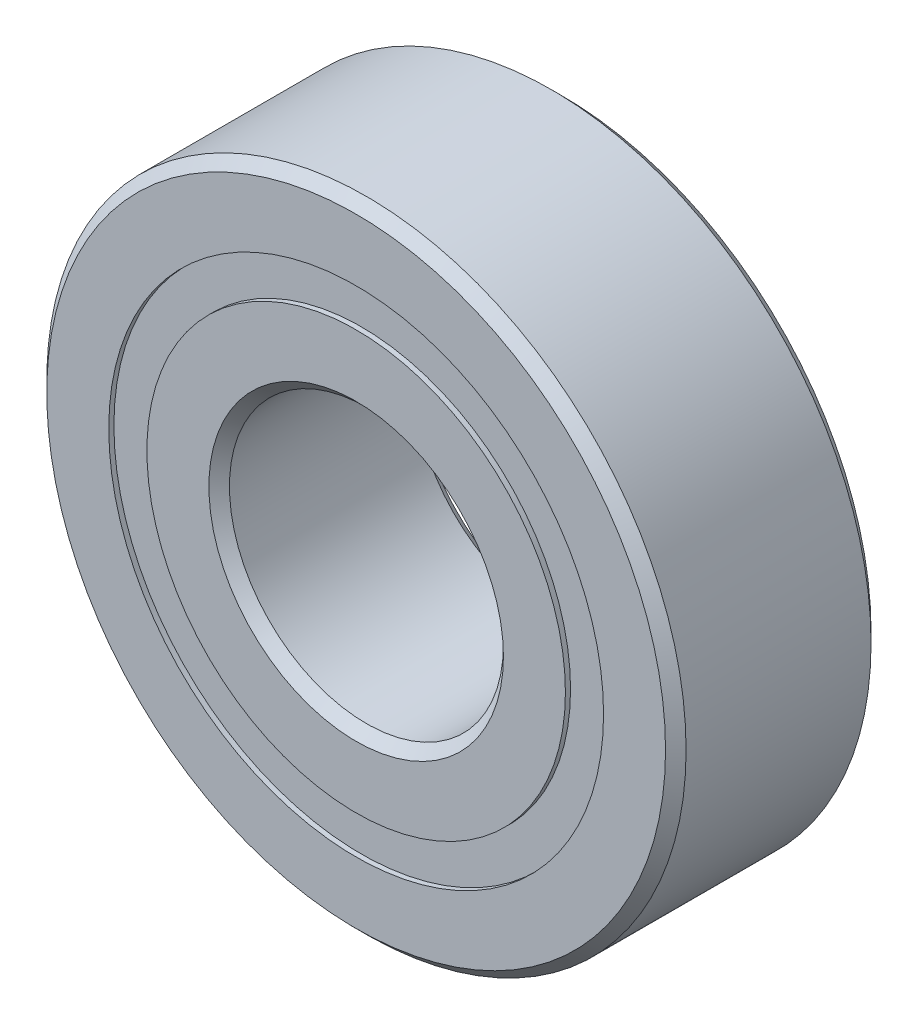
ISO-10303-21;
HEADER;
FILE_DESCRIPTION(('STEP AP214'),'2;1');
FILE_NAME('part.step','',(''),(''),'','','');
FILE_SCHEMA(('AUTOMOTIVE_DESIGN { 1 0 10303 214 1 1 1 1 }'));
ENDSEC;
DATA;
#1=APPLICATION_CONTEXT('core data for automotive mechanical design processes');
#2=APPLICATION_PROTOCOL_DEFINITION('international standard','automotive_design',2000,#1);
#3=PRODUCT_CONTEXT('',#1,'mechanical');
#4=PRODUCT('Part','Part','',(#3));
#5=PRODUCT_RELATED_PRODUCT_CATEGORY('part','',(#4));
#6=PRODUCT_DEFINITION_FORMATION('','',#4);
#7=PRODUCT_DEFINITION_CONTEXT('part definition',#1,'design');
#8=PRODUCT_DEFINITION('design','',#6,#7);
#9=PRODUCT_DEFINITION_SHAPE('','',#8);
#10=(LENGTH_UNIT() NAMED_UNIT(*) SI_UNIT(.MILLI.,.METRE.));
#11=(NAMED_UNIT(*) PLANE_ANGLE_UNIT() SI_UNIT($,.RADIAN.));
#12=(NAMED_UNIT(*) SI_UNIT($,.STERADIAN.) SOLID_ANGLE_UNIT());
#13=UNCERTAINTY_MEASURE_WITH_UNIT(LENGTH_MEASURE(1.E-05),#10,'distance_accuracy_value','');
#14=(GEOMETRIC_REPRESENTATION_CONTEXT(3) GLOBAL_UNCERTAINTY_ASSIGNED_CONTEXT((#13)) GLOBAL_UNIT_ASSIGNED_CONTEXT((#10,
#11,#12)) REPRESENTATION_CONTEXT('',''));
#15=CARTESIAN_POINT('',(0.,0.,0.));
#16=DIRECTION('',(0.,0.,1.));
#17=DIRECTION('',(1.,0.,0.));
#18=AXIS2_PLACEMENT_3D('',#15,#16,#17);
#19=CARTESIAN_POINT('',(0.,8.60041208791209,-3.39328125));
#20=DIRECTION('',(0.,0.,1.));
#21=DIRECTION('',(1.,0.,0.));
#22=AXIS2_PLACEMENT_3D('',#19,#20,#21);
#23=PLANE('',#22);
#24=CARTESIAN_POINT('',(0.,0.,-3.39328125));
#25=DIRECTION('',(0.,0.,1.));
#26=DIRECTION('',(1.,0.,0.));
#27=AXIS2_PLACEMENT_3D('',#24,#25,#26);
#28=CIRCLE('',#27,8.60041208791209);
#29=CARTESIAN_POINT('',(8.60041208791209,0.,-3.39328125));
#30=VERTEX_POINT('',#29);
#31=EDGE_CURVE('E59',#30,#30,#28,.T.);
#32=ORIENTED_EDGE('',*,*,#31,.F.);
#33=EDGE_LOOP('',(#32));
#34=FACE_BOUND('',#33,.T.);
#35=CARTESIAN_POINT('',(0.,0.,-3.39328125));
#36=DIRECTION('',(0.,0.,1.));
#37=DIRECTION('',(1.,0.,0.));
#38=AXIS2_PLACEMENT_3D('',#35,#36,#37);
#39=CIRCLE('',#38,7.27458791208791);
#40=CARTESIAN_POINT('',(7.27458791208791,0.,-3.39328125));
#41=VERTEX_POINT('',#40);
#42=EDGE_CURVE('E11',#41,#41,#39,.T.);
#43=ORIENTED_EDGE('',*,*,#42,.T.);
#44=EDGE_LOOP('',(#43));
#45=FACE_BOUND('',#44,.T.);
#46=ADVANCED_FACE('F45',(#34,#45),#23,.F.);
#47=CARTESIAN_POINT('',(0.,0.,3.571875));
#48=DIRECTION('',(0.,0.,1.));
#49=DIRECTION('',(1.,0.,0.));
#50=AXIS2_PLACEMENT_3D('',#47,#48,#49);
#51=CYLINDRICAL_SURFACE('',#50,7.27458791208791);
#52=ORIENTED_EDGE('',*,*,#42,.F.);
#53=EDGE_LOOP('',(#52));
#54=FACE_BOUND('',#53,.T.);
#55=CARTESIAN_POINT('',(0.,0.,-1.72035132641561));
#56=DIRECTION('',(0.,0.,1.));
#57=DIRECTION('',(1.,0.,0.));
#58=AXIS2_PLACEMENT_3D('',#55,#56,#57);
#59=CIRCLE('',#58,7.27458791208791);
#60=CARTESIAN_POINT('',(7.27458791208791,0.,-1.72035132641561));
#61=VERTEX_POINT('',#60);
#62=EDGE_CURVE('E51',#61,#61,#59,.T.);
#63=ORIENTED_EDGE('',*,*,#62,.T.);
#64=EDGE_LOOP('',(#63));
#65=FACE_BOUND('',#64,.T.);
#66=ADVANCED_FACE('F68',(#54,#65),#51,.F.);
#67=CARTESIAN_POINT('',(0.,8.60041208791209,-1.72035132641561));
#68=DIRECTION('',(0.,0.,-1.));
#69=DIRECTION('',(-1.,0.,0.));
#70=AXIS2_PLACEMENT_3D('',#67,#68,#69);
#71=PLANE('',#70);
#72=ORIENTED_EDGE('',*,*,#62,.F.);
#73=EDGE_LOOP('',(#72));
#74=FACE_BOUND('',#73,.T.);
#75=CARTESIAN_POINT('',(0.,0.,-1.72035132641561));
#76=DIRECTION('',(0.,0.,1.));
#77=DIRECTION('',(1.,0.,0.));
#78=AXIS2_PLACEMENT_3D('',#75,#76,#77);
#79=CIRCLE('',#78,8.60041208791209);
#80=CARTESIAN_POINT('',(8.60041208791209,0.,-1.72035132641561));
#81=VERTEX_POINT('',#80);
#82=EDGE_CURVE('E55',#81,#81,#79,.T.);
#83=ORIENTED_EDGE('',*,*,#82,.T.);
#84=EDGE_LOOP('',(#83));
#85=FACE_BOUND('',#84,.T.);
#86=ADVANCED_FACE('F72',(#74,#85),#71,.F.);
#87=CARTESIAN_POINT('',(0.,0.,3.571875));
#88=DIRECTION('',(0.,0.,1.));
#89=DIRECTION('',(1.,0.,0.));
#90=AXIS2_PLACEMENT_3D('',#87,#88,#89);
#91=CYLINDRICAL_SURFACE('',#90,8.60041208791209);
#92=ORIENTED_EDGE('',*,*,#82,.F.);
#93=EDGE_LOOP('',(#92));
#94=FACE_BOUND('',#93,.T.);
#95=ORIENTED_EDGE('',*,*,#31,.T.);
#96=EDGE_LOOP('',(#95));
#97=FACE_BOUND('',#96,.T.);
#98=ADVANCED_FACE('F65',(#94,#97),#91,.T.);
#99=CLOSED_SHELL('',(#46,#66,#86,#98));
#100=MANIFOLD_SOLID_BREP('B2',#99);
#101=CARTESIAN_POINT('',(0.,8.60041208791209,3.39328125));
#102=DIRECTION('',(0.,0.,-1.));
#103=DIRECTION('',(-1.,0.,0.));
#104=AXIS2_PLACEMENT_3D('',#101,#102,#103);
#105=PLANE('',#104);
#106=CARTESIAN_POINT('',(0.,0.,3.39328125));
#107=DIRECTION('',(0.,0.,1.));
#108=DIRECTION('',(1.,0.,0.));
#109=AXIS2_PLACEMENT_3D('',#106,#107,#108);
#110=CIRCLE('',#109,7.27458791208791);
#111=CARTESIAN_POINT('',(7.27458791208791,0.,3.39328125));
#112=VERTEX_POINT('',#111);
#113=EDGE_CURVE('E44',#112,#112,#110,.T.);
#114=ORIENTED_EDGE('',*,*,#113,.F.);
#115=EDGE_LOOP('',(#114));
#116=FACE_BOUND('',#115,.T.);
#117=CARTESIAN_POINT('',(0.,0.,3.39328125));
#118=DIRECTION('',(0.,0.,1.));
#119=DIRECTION('',(1.,0.,0.));
#120=AXIS2_PLACEMENT_3D('',#117,#118,#119);
#121=CIRCLE('',#120,8.60041208791209);
#122=CARTESIAN_POINT('',(8.60041208791209,0.,3.39328125));
#123=VERTEX_POINT('',#122);
#124=EDGE_CURVE('E126',#123,#123,#121,.T.);
#125=ORIENTED_EDGE('',*,*,#124,.T.);
#126=EDGE_LOOP('',(#125));
#127=FACE_BOUND('',#126,.T.);
#128=ADVANCED_FACE('F112',(#116,#127),#105,.F.);
#129=CARTESIAN_POINT('',(0.,0.,3.571875));
#130=DIRECTION('',(0.,0.,1.));
#131=DIRECTION('',(1.,0.,0.));
#132=AXIS2_PLACEMENT_3D('',#129,#130,#131);
#133=CYLINDRICAL_SURFACE('',#132,7.27458791208791);
#134=CARTESIAN_POINT('',(0.,0.,1.72035132641561));
#135=DIRECTION('',(0.,0.,1.));
#136=DIRECTION('',(1.,0.,0.));
#137=AXIS2_PLACEMENT_3D('',#134,#135,#136);
#138=CIRCLE('',#137,7.27458791208791);
#139=CARTESIAN_POINT('',(7.27458791208791,0.,1.72035132641561));
#140=VERTEX_POINT('',#139);
#141=EDGE_CURVE('E118',#140,#140,#138,.T.);
#142=ORIENTED_EDGE('',*,*,#141,.F.);
#143=EDGE_LOOP('',(#142));
#144=FACE_BOUND('',#143,.T.);
#145=ORIENTED_EDGE('',*,*,#113,.T.);
#146=EDGE_LOOP('',(#145));
#147=FACE_BOUND('',#146,.T.);
#148=ADVANCED_FACE('F141',(#144,#147),#133,.F.);
#149=CARTESIAN_POINT('',(0.,8.60041208791209,1.72035132641562));
#150=DIRECTION('',(0.,0.,1.));
#151=DIRECTION('',(1.,0.,0.));
#152=AXIS2_PLACEMENT_3D('',#149,#150,#151);
#153=PLANE('',#152);
#154=CARTESIAN_POINT('',(0.,0.,1.72035132641562));
#155=DIRECTION('',(0.,0.,1.));
#156=DIRECTION('',(1.,0.,0.));
#157=AXIS2_PLACEMENT_3D('',#154,#155,#156);
#158=CIRCLE('',#157,8.60041208791209);
#159=CARTESIAN_POINT('',(8.60041208791209,0.,1.72035132641562));
#160=VERTEX_POINT('',#159);
#161=EDGE_CURVE('E122',#160,#160,#158,.T.);
#162=ORIENTED_EDGE('',*,*,#161,.F.);
#163=EDGE_LOOP('',(#162));
#164=FACE_BOUND('',#163,.T.);
#165=ORIENTED_EDGE('',*,*,#141,.T.);
#166=EDGE_LOOP('',(#165));
#167=FACE_BOUND('',#166,.T.);
#168=ADVANCED_FACE('F136',(#164,#167),#153,.F.);
#169=CARTESIAN_POINT('',(0.,0.,3.571875));
#170=DIRECTION('',(0.,0.,1.));
#171=DIRECTION('',(1.,0.,0.));
#172=AXIS2_PLACEMENT_3D('',#169,#170,#171);
#173=CYLINDRICAL_SURFACE('',#172,8.60041208791209);
#174=ORIENTED_EDGE('',*,*,#124,.F.);
#175=EDGE_LOOP('',(#174));
#176=FACE_BOUND('',#175,.T.);
#177=ORIENTED_EDGE('',*,*,#161,.T.);
#178=EDGE_LOOP('',(#177));
#179=FACE_BOUND('',#178,.T.);
#180=ADVANCED_FACE('F133',(#176,#179),#173,.T.);
#181=CLOSED_SHELL('',(#128,#148,#168,#180));
#182=MANIFOLD_SOLID_BREP('B6',#181);
#183=CARTESIAN_POINT('',(-4.66554544007142,6.42157239285121,0.));
#184=DIRECTION('',(0.,0.,1.));
#185=DIRECTION('',(-0.587785252292462,0.809016994374955,0.));
#186=AXIS2_PLACEMENT_3D('',#183,#184,#185);
#187=SPHERICAL_SURFACE('',#186,1.72035132641561);
#188=CARTESIAN_POINT('',(-4.66554544007142,6.42157239285121,1.72035132641562));
#189=VERTEX_POINT('',#188);
#190=VERTEX_LOOP('',#189);
#191=FACE_BOUND('',#190,.T.);
#192=ADVANCED_FACE('F179',(#191),#187,.T.);
#193=CLOSED_SHELL('',(#192));
#194=MANIFOLD_SOLID_BREP('B39',#193);
#195=CARTESIAN_POINT('',(-7.54901109809275,2.45282239285123,0.));
#196=DIRECTION('',(0.,0.,1.));
#197=DIRECTION('',(-0.95105651629515,0.309016994374958,0.));
#198=AXIS2_PLACEMENT_3D('',#195,#196,#197);
#199=SPHERICAL_SURFACE('',#198,1.72035132641561);
#200=CARTESIAN_POINT('',(-7.54901109809275,2.45282239285123,1.72035132641562));
#201=VERTEX_POINT('',#200);
#202=VERTEX_LOOP('',#201);
#203=FACE_BOUND('',#202,.T.);
#204=ADVANCED_FACE('F199',(#203),#199,.T.);
#205=CLOSED_SHELL('',(#204));
#206=MANIFOLD_SOLID_BREP('B108',#205);
#207=CARTESIAN_POINT('',(-7.54901109809281,-2.45282239285107,0.));
#208=DIRECTION('',(0.,0.,1.));
#209=DIRECTION('',(-0.951056516295157,-0.309016994374938,0.));
#210=AXIS2_PLACEMENT_3D('',#207,#208,#209);
#211=SPHERICAL_SURFACE('',#210,1.72035132641561);
#212=CARTESIAN_POINT('',(-7.54901109809281,-2.45282239285107,1.72035132641562));
#213=VERTEX_POINT('',#212);
#214=VERTEX_LOOP('',#213);
#215=FACE_BOUND('',#214,.T.);
#216=ADVANCED_FACE('F219',(#215),#211,.T.);
#217=CLOSED_SHELL('',(#216));
#218=MANIFOLD_SOLID_BREP('B175',#217);
#219=CARTESIAN_POINT('',(-4.66554544007156,-6.4215723928511,0.));
#220=DIRECTION('',(0.,0.,1.));
#221=DIRECTION('',(-0.58778525229248,-0.809016994374942,0.));
#222=AXIS2_PLACEMENT_3D('',#219,#220,#221);
#223=SPHERICAL_SURFACE('',#222,1.72035132641561);
#224=CARTESIAN_POINT('',(-4.66554544007156,-6.4215723928511,1.72035132641562));
#225=VERTEX_POINT('',#224);
#226=VERTEX_LOOP('',#225);
#227=FACE_BOUND('',#226,.T.);
#228=ADVANCED_FACE('F239',(#227),#223,.T.);
#229=CLOSED_SHELL('',(#228));
#230=MANIFOLD_SOLID_BREP('B195',#229);
#231=CARTESIAN_POINT('',(0.,-7.9375,0.));
#232=DIRECTION('',(0.,0.,1.));
#233=DIRECTION('',(0.,-1.,0.));
#234=AXIS2_PLACEMENT_3D('',#231,#232,#233);
#235=SPHERICAL_SURFACE('',#234,1.72035132641561);
#236=CARTESIAN_POINT('',(0.,-7.9375,1.72035132641562));
#237=VERTEX_POINT('',#236);
#238=VERTEX_LOOP('',#237);
#239=FACE_BOUND('',#238,.T.);
#240=ADVANCED_FACE('F259',(#239),#235,.T.);
#241=CLOSED_SHELL('',(#240));
#242=MANIFOLD_SOLID_BREP('B215',#241);
#243=CARTESIAN_POINT('',(4.66554544007147,-6.42157239285117,0.));
#244=DIRECTION('',(0.,0.,1.));
#245=DIRECTION('',(0.587785252292469,-0.809016994374951,0.));
#246=AXIS2_PLACEMENT_3D('',#243,#244,#245);
#247=SPHERICAL_SURFACE('',#246,1.72035132641561);
#248=CARTESIAN_POINT('',(4.66554544007147,-6.42157239285117,1.72035132641562));
#249=VERTEX_POINT('',#248);
#250=VERTEX_LOOP('',#249);
#251=FACE_BOUND('',#250,.T.);
#252=ADVANCED_FACE('F279',(#251),#247,.T.);
#253=CLOSED_SHELL('',(#252));
#254=MANIFOLD_SOLID_BREP('B235',#253);
#255=CARTESIAN_POINT('',(7.54901109809277,-2.45282239285118,0.));
#256=DIRECTION('',(0.,0.,1.));
#257=DIRECTION('',(0.951056516295152,-0.309016994374952,0.));
#258=AXIS2_PLACEMENT_3D('',#255,#256,#257);
#259=SPHERICAL_SURFACE('',#258,1.72035132641561);
#260=CARTESIAN_POINT('',(7.54901109809277,-2.45282239285118,1.72035132641562));
#261=VERTEX_POINT('',#260);
#262=VERTEX_LOOP('',#261);
#263=FACE_BOUND('',#262,.T.);
#264=ADVANCED_FACE('F299',(#263),#259,.T.);
#265=CLOSED_SHELL('',(#264));
#266=MANIFOLD_SOLID_BREP('B255',#265);
#267=CARTESIAN_POINT('',(7.54901109809279,2.45282239285112,0.));
#268=DIRECTION('',(0.,0.,1.));
#269=DIRECTION('',(0.951056516295155,0.309016994374945,0.));
#270=AXIS2_PLACEMENT_3D('',#267,#268,#269);
#271=SPHERICAL_SURFACE('',#270,1.72035132641561);
#272=CARTESIAN_POINT('',(7.54901109809279,2.45282239285112,1.72035132641562));
#273=VERTEX_POINT('',#272);
#274=VERTEX_LOOP('',#273);
#275=FACE_BOUND('',#274,.T.);
#276=ADVANCED_FACE('F319',(#275),#271,.T.);
#277=CLOSED_SHELL('',(#276));
#278=MANIFOLD_SOLID_BREP('B275',#277);
#279=CARTESIAN_POINT('',(4.66554544007152,6.42157239285114,0.));
#280=DIRECTION('',(0.,0.,1.));
#281=DIRECTION('',(0.587785252292474,0.809016994374947,0.));
#282=AXIS2_PLACEMENT_3D('',#279,#280,#281);
#283=SPHERICAL_SURFACE('',#282,1.72035132641561);
#284=CARTESIAN_POINT('',(4.66554544007152,6.42157239285114,1.72035132641562));
#285=VERTEX_POINT('',#284);
#286=VERTEX_LOOP('',#285);
#287=FACE_BOUND('',#286,.T.);
#288=ADVANCED_FACE('F339',(#287),#283,.T.);
#289=CLOSED_SHELL('',(#288));
#290=MANIFOLD_SOLID_BREP('B295',#289);
#291=CARTESIAN_POINT('',(0.,7.9375,0.));
#292=DIRECTION('',(0.,0.,1.));
#293=DIRECTION('',(0.,1.,0.));
#294=AXIS2_PLACEMENT_3D('',#291,#292,#293);
#295=SPHERICAL_SURFACE('',#294,1.72035132641561);
#296=CARTESIAN_POINT('',(0.,7.9375,1.72035132641562));
#297=VERTEX_POINT('',#296);
#298=VERTEX_LOOP('',#297);
#299=FACE_BOUND('',#298,.T.);
#300=ADVANCED_FACE('F361',(#299),#295,.T.);
#301=CLOSED_SHELL('',(#300));
#302=MANIFOLD_SOLID_BREP('B315',#301);
#303=CARTESIAN_POINT('',(0.,7.27458791208791,3.571875));
#304=DIRECTION('',(0.,0.,-1.));
#305=DIRECTION('',(-1.,0.,0.));
#306=AXIS2_PLACEMENT_3D('',#303,#304,#305);
#307=PLANE('',#306);
#308=CARTESIAN_POINT('',(0.,0.,3.571875));
#309=DIRECTION('',(0.,0.,1.));
#310=DIRECTION('',(1.,0.,0.));
#311=AXIS2_PLACEMENT_3D('',#308,#309,#310);
#312=CIRCLE('',#311,5.1196875);
#313=CARTESIAN_POINT('',(5.1196875,0.,3.571875));
#314=VERTEX_POINT('',#313);
#315=EDGE_CURVE('E408',#314,#314,#312,.T.);
#316=ORIENTED_EDGE('',*,*,#315,.F.);
#317=EDGE_LOOP('',(#316));
#318=FACE_BOUND('',#317,.T.);
#319=CARTESIAN_POINT('',(0.,0.,3.571875));
#320=DIRECTION('',(0.,0.,1.));
#321=DIRECTION('',(1.,0.,0.));
#322=AXIS2_PLACEMENT_3D('',#319,#320,#321);
#323=CIRCLE('',#322,7.27458791208791);
#324=CARTESIAN_POINT('',(7.27458791208791,0.,3.571875));
#325=VERTEX_POINT('',#324);
#326=EDGE_CURVE('E360',#325,#325,#323,.T.);
#327=ORIENTED_EDGE('',*,*,#326,.T.);
#328=EDGE_LOOP('',(#327));
#329=FACE_BOUND('',#328,.T.);
#330=ADVANCED_FACE('F380',(#318,#329),#307,.F.);
#331=CARTESIAN_POINT('',(0.,0.,3.571875));
#332=DIRECTION('',(0.,0.,1.));
#333=DIRECTION('',(1.,0.,0.));
#334=AXIS2_PLACEMENT_3D('',#331,#332,#333);
#335=CYLINDRICAL_SURFACE('',#334,7.27458791208791);
#336=ORIENTED_EDGE('',*,*,#326,.F.);
#337=EDGE_LOOP('',(#336));
#338=FACE_BOUND('',#337,.T.);
#339=CARTESIAN_POINT('',(0.,0.,1.5875));
#340=DIRECTION('',(0.,0.,1.));
#341=DIRECTION('',(1.,0.,0.));
#342=AXIS2_PLACEMENT_3D('',#339,#340,#341);
#343=CIRCLE('',#342,7.27458791208791);
#344=CARTESIAN_POINT('',(7.27458791208791,0.,1.5875));
#345=VERTEX_POINT('',#344);
#346=EDGE_CURVE('E386',#345,#345,#343,.T.);
#347=ORIENTED_EDGE('',*,*,#346,.T.);
#348=EDGE_LOOP('',(#347));
#349=FACE_BOUND('',#348,.T.);
#350=ADVANCED_FACE('F415',(#338,#349),#335,.T.);
#351=CARTESIAN_POINT('',(0.,0.,0.));
#352=DIRECTION('',(0.,0.,1.));
#353=DIRECTION('',(1.,0.,0.));
#354=AXIS2_PLACEMENT_3D('',#351,#352,#353);
#355=TOROIDAL_SURFACE('',#354,7.93749999999999,1.72035132641561);
#356=ORIENTED_EDGE('',*,*,#346,.F.);
#357=EDGE_LOOP('',(#356));
#358=FACE_BOUND('',#357,.T.);
#359=CARTESIAN_POINT('',(0.,0.,-1.5875));
#360=DIRECTION('',(0.,0.,1.));
#361=DIRECTION('',(1.,0.,0.));
#362=AXIS2_PLACEMENT_3D('',#359,#360,#361);
#363=CIRCLE('',#362,7.27458791208791);
#364=CARTESIAN_POINT('',(7.27458791208791,0.,-1.5875));
#365=VERTEX_POINT('',#364);
#366=EDGE_CURVE('E390',#365,#365,#363,.T.);
#367=ORIENTED_EDGE('',*,*,#366,.T.);
#368=EDGE_LOOP('',(#367));
#369=FACE_BOUND('',#368,.T.);
#370=ADVANCED_FACE('F419',(#358,#369),#355,.F.);
#371=CARTESIAN_POINT('',(0.,0.,3.571875));
#372=DIRECTION('',(0.,0.,1.));
#373=DIRECTION('',(1.,0.,0.));
#374=AXIS2_PLACEMENT_3D('',#371,#372,#373);
#375=CYLINDRICAL_SURFACE('',#374,7.27458791208791);
#376=ORIENTED_EDGE('',*,*,#366,.F.);
#377=EDGE_LOOP('',(#376));
#378=FACE_BOUND('',#377,.T.);
#379=CARTESIAN_POINT('',(0.,0.,-3.571875));
#380=DIRECTION('',(0.,0.,1.));
#381=DIRECTION('',(1.,0.,0.));
#382=AXIS2_PLACEMENT_3D('',#379,#380,#381);
#383=CIRCLE('',#382,7.27458791208791);
#384=CARTESIAN_POINT('',(7.27458791208791,0.,-3.571875));
#385=VERTEX_POINT('',#384);
#386=EDGE_CURVE('E394',#385,#385,#383,.T.);
#387=ORIENTED_EDGE('',*,*,#386,.T.);
#388=EDGE_LOOP('',(#387));
#389=FACE_BOUND('',#388,.T.);
#390=ADVANCED_FACE('F424',(#378,#389),#375,.T.);
#391=CARTESIAN_POINT('',(0.,5.1196875,-3.571875));
#392=DIRECTION('',(0.,0.,1.));
#393=DIRECTION('',(1.,0.,0.));
#394=AXIS2_PLACEMENT_3D('',#391,#392,#393);
#395=PLANE('',#394);
#396=ORIENTED_EDGE('',*,*,#386,.F.);
#397=EDGE_LOOP('',(#396));
#398=FACE_BOUND('',#397,.T.);
#399=CARTESIAN_POINT('',(0.,0.,-3.571875));
#400=DIRECTION('',(0.,0.,1.));
#401=DIRECTION('',(1.,0.,0.));
#402=AXIS2_PLACEMENT_3D('',#399,#400,#401);
#403=CIRCLE('',#402,5.1196875);
#404=CARTESIAN_POINT('',(5.1196875,0.,-3.571875));
#405=VERTEX_POINT('',#404);
#406=EDGE_CURVE('E399',#405,#405,#403,.T.);
#407=ORIENTED_EDGE('',*,*,#406,.T.);
#408=EDGE_LOOP('',(#407));
#409=FACE_BOUND('',#408,.T.);
#410=ADVANCED_FACE('F430',(#398,#409),#395,.F.);
#411=CARTESIAN_POINT('',(0.,0.,-3.2146875));
#412=DIRECTION('',(0.,0.,-1.));
#413=DIRECTION('',(-1.,0.,0.));
#414=AXIS2_PLACEMENT_3D('',#411,#412,#413);
#415=CONICAL_SURFACE('',#414,4.7625,0.785398163397444);
#416=ORIENTED_EDGE('',*,*,#406,.F.);
#417=EDGE_LOOP('',(#416));
#418=FACE_BOUND('',#417,.T.);
#419=CARTESIAN_POINT('',(0.,0.,-3.2146875));
#420=DIRECTION('',(0.,0.,1.));
#421=DIRECTION('',(1.,0.,0.));
#422=AXIS2_PLACEMENT_3D('',#419,#420,#421);
#423=CIRCLE('',#422,4.7625);
#424=CARTESIAN_POINT('',(4.7625,0.,-3.2146875));
#425=VERTEX_POINT('',#424);
#426=EDGE_CURVE('E402',#425,#425,#423,.T.);
#427=ORIENTED_EDGE('',*,*,#426,.T.);
#428=EDGE_LOOP('',(#427));
#429=FACE_BOUND('',#428,.T.);
#430=ADVANCED_FACE('F434',(#418,#429),#415,.F.);
#431=CARTESIAN_POINT('',(0.,0.,3.571875));
#432=DIRECTION('',(0.,0.,1.));
#433=DIRECTION('',(1.,0.,0.));
#434=AXIS2_PLACEMENT_3D('',#431,#432,#433);
#435=CYLINDRICAL_SURFACE('',#434,4.7625);
#436=ORIENTED_EDGE('',*,*,#426,.F.);
#437=EDGE_LOOP('',(#436));
#438=FACE_BOUND('',#437,.T.);
#439=CARTESIAN_POINT('',(0.,0.,3.2146875));
#440=DIRECTION('',(0.,0.,1.));
#441=DIRECTION('',(1.,0.,0.));
#442=AXIS2_PLACEMENT_3D('',#439,#440,#441);
#443=CIRCLE('',#442,4.7625);
#444=CARTESIAN_POINT('',(4.7625,0.,3.2146875));
#445=VERTEX_POINT('',#444);
#446=EDGE_CURVE('E405',#445,#445,#443,.T.);
#447=ORIENTED_EDGE('',*,*,#446,.T.);
#448=EDGE_LOOP('',(#447));
#449=FACE_BOUND('',#448,.T.);
#450=ADVANCED_FACE('F438',(#438,#449),#435,.F.);
#451=CARTESIAN_POINT('',(0.,0.,3.571875));
#452=DIRECTION('',(0.,0.,1.));
#453=DIRECTION('',(1.,0.,0.));
#454=AXIS2_PLACEMENT_3D('',#451,#452,#453);
#455=CONICAL_SURFACE('',#454,5.1196875,0.785398163397453);
#456=ORIENTED_EDGE('',*,*,#446,.F.);
#457=EDGE_LOOP('',(#456));
#458=FACE_BOUND('',#457,.T.);
#459=ORIENTED_EDGE('',*,*,#315,.T.);
#460=EDGE_LOOP('',(#459));
#461=FACE_BOUND('',#460,.T.);
#462=ADVANCED_FACE('F412',(#458,#461),#455,.F.);
#463=CLOSED_SHELL('',(#330,#350,#370,#390,#410,#430,#450,#462));
#464=MANIFOLD_SOLID_BREP('B335',#463);
#465=CARTESIAN_POINT('',(0.,0.,3.2146875));
#466=DIRECTION('',(0.,0.,-1.));
#467=DIRECTION('',(-1.,0.,0.));
#468=AXIS2_PLACEMENT_3D('',#465,#466,#467);
#469=CONICAL_SURFACE('',#468,11.1125,0.785398163397446);
#470=CARTESIAN_POINT('',(0.,0.,3.571875));
#471=DIRECTION('',(0.,0.,1.));
#472=DIRECTION('',(1.,0.,0.));
#473=AXIS2_PLACEMENT_3D('',#470,#471,#472);
#474=CIRCLE('',#473,10.7553125);
#475=CARTESIAN_POINT('',(10.7553125,0.,3.571875));
#476=VERTEX_POINT('',#475);
#477=EDGE_CURVE('E529',#476,#476,#474,.T.);
#478=ORIENTED_EDGE('',*,*,#477,.F.);
#479=EDGE_LOOP('',(#478));
#480=FACE_BOUND('',#479,.T.);
#481=CARTESIAN_POINT('',(0.,0.,3.2146875));
#482=DIRECTION('',(0.,0.,1.));
#483=DIRECTION('',(1.,0.,0.));
#484=AXIS2_PLACEMENT_3D('',#481,#482,#483);
#485=CIRCLE('',#484,11.1125);
#486=CARTESIAN_POINT('',(11.1125,0.,3.2146875));
#487=VERTEX_POINT('',#486);
#488=EDGE_CURVE('E379',#487,#487,#485,.T.);
#489=ORIENTED_EDGE('',*,*,#488,.T.);
#490=EDGE_LOOP('',(#489));
#491=FACE_BOUND('',#490,.T.);
#492=ADVANCED_FACE('F501',(#480,#491),#469,.T.);
#493=CARTESIAN_POINT('',(0.,0.,3.571875));
#494=DIRECTION('',(0.,0.,1.));
#495=DIRECTION('',(1.,0.,0.));
#496=AXIS2_PLACEMENT_3D('',#493,#494,#495);
#497=CYLINDRICAL_SURFACE('',#496,11.1125);
#498=ORIENTED_EDGE('',*,*,#488,.F.);
#499=EDGE_LOOP('',(#498));
#500=FACE_BOUND('',#499,.T.);
#501=CARTESIAN_POINT('',(0.,0.,-3.2146875));
#502=DIRECTION('',(0.,0.,1.));
#503=DIRECTION('',(1.,0.,0.));
#504=AXIS2_PLACEMENT_3D('',#501,#502,#503);
#505=CIRCLE('',#504,11.1125);
#506=CARTESIAN_POINT('',(11.1125,0.,-3.2146875));
#507=VERTEX_POINT('',#506);
#508=EDGE_CURVE('E507',#507,#507,#505,.T.);
#509=ORIENTED_EDGE('',*,*,#508,.T.);
#510=EDGE_LOOP('',(#509));
#511=FACE_BOUND('',#510,.T.);
#512=ADVANCED_FACE('F536',(#500,#511),#497,.T.);
#513=CARTESIAN_POINT('',(0.,0.,-3.571875));
#514=DIRECTION('',(0.,0.,1.));
#515=DIRECTION('',(1.,0.,0.));
#516=AXIS2_PLACEMENT_3D('',#513,#514,#515);
#517=CONICAL_SURFACE('',#516,10.7553125,0.785398163397444);
#518=ORIENTED_EDGE('',*,*,#508,.F.);
#519=EDGE_LOOP('',(#518));
#520=FACE_BOUND('',#519,.T.);
#521=CARTESIAN_POINT('',(0.,0.,-3.571875));
#522=DIRECTION('',(0.,0.,1.));
#523=DIRECTION('',(1.,0.,0.));
#524=AXIS2_PLACEMENT_3D('',#521,#522,#523);
#525=CIRCLE('',#524,10.7553125);
#526=CARTESIAN_POINT('',(10.7553125,0.,-3.571875));
#527=VERTEX_POINT('',#526);
#528=EDGE_CURVE('E511',#527,#527,#525,.T.);
#529=ORIENTED_EDGE('',*,*,#528,.T.);
#530=EDGE_LOOP('',(#529));
#531=FACE_BOUND('',#530,.T.);
#532=ADVANCED_FACE('F540',(#520,#531),#517,.T.);
#533=CARTESIAN_POINT('',(0.,10.7553125,-3.571875));
#534=DIRECTION('',(0.,0.,1.));
#535=DIRECTION('',(1.,0.,0.));
#536=AXIS2_PLACEMENT_3D('',#533,#534,#535);
#537=PLANE('',#536);
#538=ORIENTED_EDGE('',*,*,#528,.F.);
#539=EDGE_LOOP('',(#538));
#540=FACE_BOUND('',#539,.T.);
#541=CARTESIAN_POINT('',(0.,0.,-3.571875));
#542=DIRECTION('',(0.,0.,1.));
#543=DIRECTION('',(1.,0.,0.));
#544=AXIS2_PLACEMENT_3D('',#541,#542,#543);
#545=CIRCLE('',#544,8.60041208791209);
#546=CARTESIAN_POINT('',(8.60041208791209,0.,-3.571875));
#547=VERTEX_POINT('',#546);
#548=EDGE_CURVE('E515',#547,#547,#545,.T.);
#549=ORIENTED_EDGE('',*,*,#548,.T.);
#550=EDGE_LOOP('',(#549));
#551=FACE_BOUND('',#550,.T.);
#552=ADVANCED_FACE('F545',(#540,#551),#537,.F.);
#553=CARTESIAN_POINT('',(0.,0.,3.571875));
#554=DIRECTION('',(0.,0.,1.));
#555=DIRECTION('',(1.,0.,0.));
#556=AXIS2_PLACEMENT_3D('',#553,#554,#555);
#557=CYLINDRICAL_SURFACE('',#556,8.60041208791209);
#558=ORIENTED_EDGE('',*,*,#548,.F.);
#559=EDGE_LOOP('',(#558));
#560=FACE_BOUND('',#559,.T.);
#561=CARTESIAN_POINT('',(0.,0.,-1.5875));
#562=DIRECTION('',(0.,0.,1.));
#563=DIRECTION('',(1.,0.,0.));
#564=AXIS2_PLACEMENT_3D('',#561,#562,#563);
#565=CIRCLE('',#564,8.60041208791209);
#566=CARTESIAN_POINT('',(8.60041208791209,0.,-1.5875));
#567=VERTEX_POINT('',#566);
#568=EDGE_CURVE('E520',#567,#567,#565,.T.);
#569=ORIENTED_EDGE('',*,*,#568,.T.);
#570=EDGE_LOOP('',(#569));
#571=FACE_BOUND('',#570,.T.);
#572=ADVANCED_FACE('F551',(#560,#571),#557,.F.);
#573=CARTESIAN_POINT('',(0.,0.,0.));
#574=DIRECTION('',(0.,0.,1.));
#575=DIRECTION('',(1.,0.,0.));
#576=AXIS2_PLACEMENT_3D('',#573,#574,#575);
#577=TOROIDAL_SURFACE('',#576,7.9375,1.72035132641561);
#578=ORIENTED_EDGE('',*,*,#568,.F.);
#579=EDGE_LOOP('',(#578));
#580=FACE_BOUND('',#579,.T.);
#581=CARTESIAN_POINT('',(0.,0.,1.5875));
#582=DIRECTION('',(0.,0.,1.));
#583=DIRECTION('',(1.,0.,0.));
#584=AXIS2_PLACEMENT_3D('',#581,#582,#583);
#585=CIRCLE('',#584,8.60041208791209);
#586=CARTESIAN_POINT('',(8.60041208791209,0.,1.5875));
#587=VERTEX_POINT('',#586);
#588=EDGE_CURVE('E523',#587,#587,#585,.T.);
#589=ORIENTED_EDGE('',*,*,#588,.T.);
#590=EDGE_LOOP('',(#589));
#591=FACE_BOUND('',#590,.T.);
#592=ADVANCED_FACE('F555',(#580,#591),#577,.F.);
#593=CARTESIAN_POINT('',(0.,0.,3.571875));
#594=DIRECTION('',(0.,0.,1.));
#595=DIRECTION('',(1.,0.,0.));
#596=AXIS2_PLACEMENT_3D('',#593,#594,#595);
#597=CYLINDRICAL_SURFACE('',#596,8.60041208791209);
#598=ORIENTED_EDGE('',*,*,#588,.F.);
#599=EDGE_LOOP('',(#598));
#600=FACE_BOUND('',#599,.T.);
#601=CARTESIAN_POINT('',(0.,0.,3.571875));
#602=DIRECTION('',(0.,0.,1.));
#603=DIRECTION('',(1.,0.,0.));
#604=AXIS2_PLACEMENT_3D('',#601,#602,#603);
#605=CIRCLE('',#604,8.60041208791209);
#606=CARTESIAN_POINT('',(8.60041208791209,0.,3.571875));
#607=VERTEX_POINT('',#606);
#608=EDGE_CURVE('E526',#607,#607,#605,.T.);
#609=ORIENTED_EDGE('',*,*,#608,.T.);
#610=EDGE_LOOP('',(#609));
#611=FACE_BOUND('',#610,.T.);
#612=ADVANCED_FACE('F559',(#600,#611),#597,.F.);
#613=CARTESIAN_POINT('',(0.,10.7553125,3.571875));
#614=DIRECTION('',(0.,0.,-1.));
#615=DIRECTION('',(-1.,0.,0.));
#616=AXIS2_PLACEMENT_3D('',#613,#614,#615);
#617=PLANE('',#616);
#618=ORIENTED_EDGE('',*,*,#608,.F.);
#619=EDGE_LOOP('',(#618));
#620=FACE_BOUND('',#619,.T.);
#621=ORIENTED_EDGE('',*,*,#477,.T.);
#622=EDGE_LOOP('',(#621));
#623=FACE_BOUND('',#622,.T.);
#624=ADVANCED_FACE('F533',(#620,#623),#617,.F.);
#625=CLOSED_SHELL('',(#492,#512,#532,#552,#572,#592,#612,#624));
#626=MANIFOLD_SOLID_BREP('B355',#625);
#627=ADVANCED_BREP_SHAPE_REPRESENTATION('',(#18,#100,#182,#194,#206,#218,#230,#242,#254,#266,
#278,#290,#302,#464,#626),#14);
#628=SHAPE_DEFINITION_REPRESENTATION(#9,#627);
ENDSEC;
END-ISO-10303-21;
